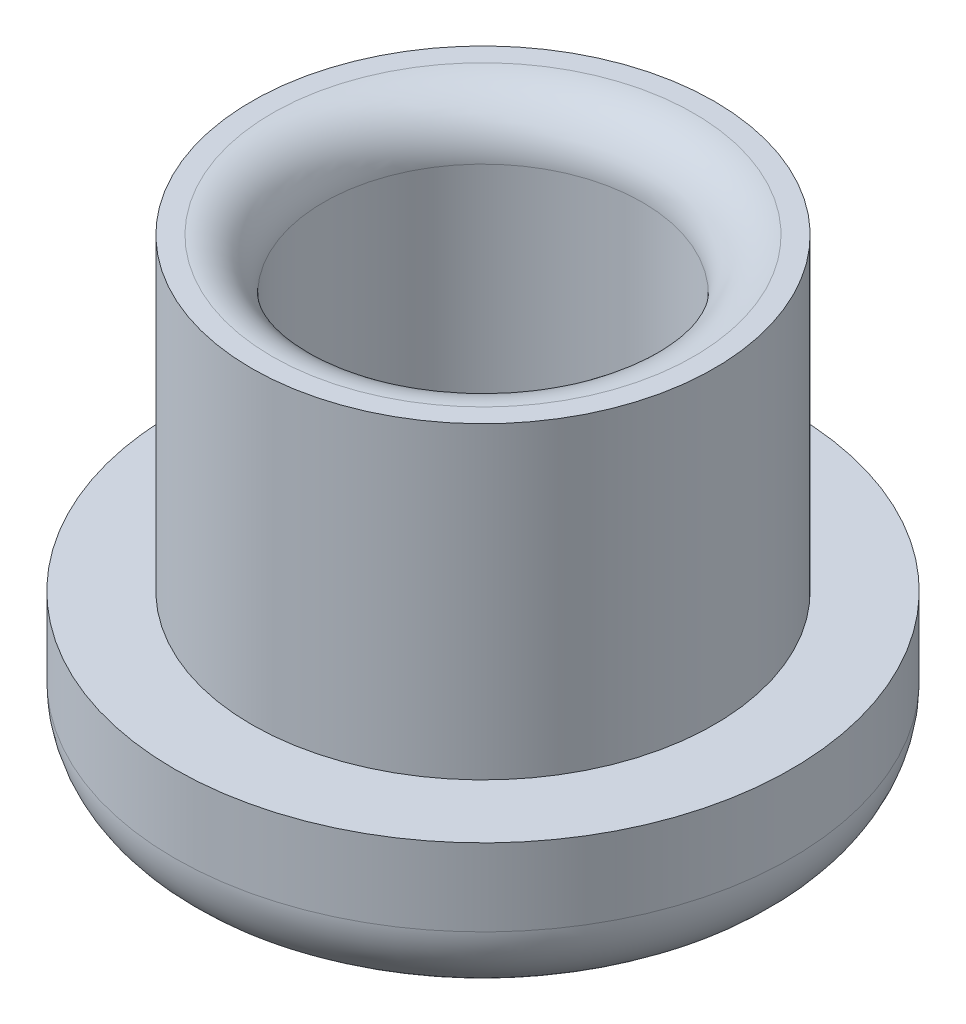
ISO-10303-21;
HEADER;
FILE_DESCRIPTION(('STEP AP214'),'2;1');
FILE_NAME('part.step','',(''),(''),'','','');
FILE_SCHEMA(('AUTOMOTIVE_DESIGN { 1 0 10303 214 1 1 1 1 }'));
ENDSEC;
DATA;
#1=APPLICATION_CONTEXT('core data for automotive mechanical design processes');
#2=APPLICATION_PROTOCOL_DEFINITION('international standard','automotive_design',2000,#1);
#3=PRODUCT_CONTEXT('',#1,'mechanical');
#4=PRODUCT('Part','Part','',(#3));
#5=PRODUCT_RELATED_PRODUCT_CATEGORY('part','',(#4));
#6=PRODUCT_DEFINITION_FORMATION('','',#4);
#7=PRODUCT_DEFINITION_CONTEXT('part definition',#1,'design');
#8=PRODUCT_DEFINITION('design','',#6,#7);
#9=PRODUCT_DEFINITION_SHAPE('','',#8);
#10=(LENGTH_UNIT() NAMED_UNIT(*) SI_UNIT(.MILLI.,.METRE.));
#11=(NAMED_UNIT(*) PLANE_ANGLE_UNIT() SI_UNIT($,.RADIAN.));
#12=(NAMED_UNIT(*) SI_UNIT($,.STERADIAN.) SOLID_ANGLE_UNIT());
#13=UNCERTAINTY_MEASURE_WITH_UNIT(LENGTH_MEASURE(1.E-05),#10,'distance_accuracy_value','');
#14=(GEOMETRIC_REPRESENTATION_CONTEXT(3) GLOBAL_UNCERTAINTY_ASSIGNED_CONTEXT((#13)) GLOBAL_UNIT_ASSIGNED_CONTEXT((#10,
#11,#12)) REPRESENTATION_CONTEXT('',''));
#15=CARTESIAN_POINT('',(0.,0.,0.));
#16=DIRECTION('',(0.,0.,1.));
#17=DIRECTION('',(1.,0.,0.));
#18=AXIS2_PLACEMENT_3D('',#15,#16,#17);
#19=CARTESIAN_POINT('',(0.,3.,0.));
#20=DIRECTION('',(0.,-1.,0.));
#21=DIRECTION('',(0.,0.,-1.));
#22=AXIS2_PLACEMENT_3D('',#19,#20,#21);
#23=CYLINDRICAL_SURFACE('',#22,6.);
#24=CARTESIAN_POINT('',(0.,1.5,0.));
#25=DIRECTION('',(0.,1.,0.));
#26=DIRECTION('',(0.,0.,1.));
#27=AXIS2_PLACEMENT_3D('',#24,#25,#26);
#28=CIRCLE('',#27,6.);
#29=CARTESIAN_POINT('',(0.,1.5,6.));
#30=VERTEX_POINT('',#29);
#31=EDGE_CURVE('E45',#30,#30,#28,.T.);
#32=ORIENTED_EDGE('',*,*,#31,.T.);
#33=EDGE_LOOP('',(#32));
#34=FACE_BOUND('',#33,.T.);
#35=CARTESIAN_POINT('',(0.,3.,0.));
#36=DIRECTION('',(0.,1.,0.));
#37=DIRECTION('',(0.,0.,1.));
#38=AXIS2_PLACEMENT_3D('',#35,#36,#37);
#39=CIRCLE('',#38,6.);
#40=CARTESIAN_POINT('',(0.,3.,6.));
#41=VERTEX_POINT('',#40);
#42=EDGE_CURVE('E64',#41,#41,#39,.T.);
#43=ORIENTED_EDGE('',*,*,#42,.F.);
#44=EDGE_LOOP('',(#43));
#45=FACE_BOUND('',#44,.T.);
#46=ADVANCED_FACE('F38',(#34,#45),#23,.T.);
#47=CARTESIAN_POINT('',(0.,3.,0.));
#48=DIRECTION('',(0.,1.,0.));
#49=DIRECTION('',(0.,0.,1.));
#50=AXIS2_PLACEMENT_3D('',#47,#48,#49);
#51=PLANE('',#50);
#52=CARTESIAN_POINT('',(0.,3.,0.));
#53=DIRECTION('',(0.,1.,0.));
#54=DIRECTION('',(0.,0.,1.));
#55=AXIS2_PLACEMENT_3D('',#52,#53,#54);
#56=CIRCLE('',#55,4.5);
#57=CARTESIAN_POINT('',(0.,3.,4.5));
#58=VERTEX_POINT('',#57);
#59=EDGE_CURVE('E68',#58,#58,#56,.T.);
#60=ORIENTED_EDGE('',*,*,#59,.F.);
#61=EDGE_LOOP('',(#60));
#62=FACE_BOUND('',#61,.T.);
#63=ORIENTED_EDGE('',*,*,#42,.T.);
#64=EDGE_LOOP('',(#63));
#65=FACE_BOUND('',#64,.T.);
#66=ADVANCED_FACE('F83',(#62,#65),#51,.T.);
#67=CARTESIAN_POINT('',(0.,0.,0.));
#68=DIRECTION('',(0.,1.,0.));
#69=DIRECTION('',(0.,0.,1.));
#70=AXIS2_PLACEMENT_3D('',#67,#68,#69);
#71=PLANE('',#70);
#72=CARTESIAN_POINT('',(0.,0.,0.));
#73=DIRECTION('',(0.,1.,0.));
#74=DIRECTION('',(0.,0.,1.));
#75=AXIS2_PLACEMENT_3D('',#72,#73,#74);
#76=CIRCLE('',#75,4.5);
#77=CARTESIAN_POINT('',(0.,0.,4.5));
#78=VERTEX_POINT('',#77);
#79=EDGE_CURVE('E11',#78,#78,#76,.F.);
#80=ORIENTED_EDGE('',*,*,#79,.T.);
#81=EDGE_LOOP('',(#80));
#82=FACE_BOUND('',#81,.T.);
#83=ADVANCED_FACE('F86',(#82),#71,.F.);
#84=CARTESIAN_POINT('',(0.,9.,0.));
#85=DIRECTION('',(0.,1.,0.));
#86=DIRECTION('',(0.,0.,1.));
#87=AXIS2_PLACEMENT_3D('',#84,#85,#86);
#88=PLANE('',#87);
#89=CARTESIAN_POINT('',(0.,9.,0.));
#90=DIRECTION('',(0.,1.,0.));
#91=DIRECTION('',(0.,0.,1.));
#92=AXIS2_PLACEMENT_3D('',#89,#90,#91);
#93=CIRCLE('',#92,4.1);
#94=CARTESIAN_POINT('',(0.,9.,4.1));
#95=VERTEX_POINT('',#94);
#96=EDGE_CURVE('E53',#95,#95,#93,.F.);
#97=ORIENTED_EDGE('',*,*,#96,.T.);
#98=EDGE_LOOP('',(#97));
#99=FACE_BOUND('',#98,.T.);
#100=CARTESIAN_POINT('',(0.,9.,0.));
#101=DIRECTION('',(0.,1.,0.));
#102=DIRECTION('',(0.,0.,1.));
#103=AXIS2_PLACEMENT_3D('',#100,#101,#102);
#104=CIRCLE('',#103,4.5);
#105=CARTESIAN_POINT('',(0.,9.,4.5));
#106=VERTEX_POINT('',#105);
#107=EDGE_CURVE('E67',#106,#106,#104,.T.);
#108=ORIENTED_EDGE('',*,*,#107,.T.);
#109=EDGE_LOOP('',(#108));
#110=FACE_BOUND('',#109,.T.);
#111=ADVANCED_FACE('F74',(#99,#110),#88,.T.);
#112=CARTESIAN_POINT('',(0.,9.,0.));
#113=DIRECTION('',(0.,-1.,0.));
#114=DIRECTION('',(0.,0.,-1.));
#115=AXIS2_PLACEMENT_3D('',#112,#113,#114);
#116=CYLINDRICAL_SURFACE('',#115,4.5);
#117=ORIENTED_EDGE('',*,*,#107,.F.);
#118=EDGE_LOOP('',(#117));
#119=FACE_BOUND('',#118,.T.);
#120=ORIENTED_EDGE('',*,*,#59,.T.);
#121=EDGE_LOOP('',(#120));
#122=FACE_BOUND('',#121,.T.);
#123=ADVANCED_FACE('F76',(#119,#122),#116,.T.);
#124=CARTESIAN_POINT('',(0.,9.,0.));
#125=DIRECTION('',(0.,-1.,0.));
#126=DIRECTION('',(0.,0.,-1.));
#127=AXIS2_PLACEMENT_3D('',#124,#125,#126);
#128=CYLINDRICAL_SURFACE('',#127,3.1);
#129=CARTESIAN_POINT('',(0.,8.,0.));
#130=DIRECTION('',(0.,1.,0.));
#131=DIRECTION('',(0.,0.,1.));
#132=AXIS2_PLACEMENT_3D('',#129,#130,#131);
#133=CIRCLE('',#132,3.1);
#134=CARTESIAN_POINT('',(0.,8.,3.1));
#135=VERTEX_POINT('',#134);
#136=EDGE_CURVE('E58',#135,#135,#133,.T.);
#137=ORIENTED_EDGE('',*,*,#136,.T.);
#138=EDGE_LOOP('',(#137));
#139=FACE_BOUND('',#138,.T.);
#140=CARTESIAN_POINT('',(0.,4.,0.));
#141=DIRECTION('',(0.,1.,0.));
#142=DIRECTION('',(0.,0.,1.));
#143=AXIS2_PLACEMENT_3D('',#140,#141,#142);
#144=CIRCLE('',#143,3.1);
#145=CARTESIAN_POINT('',(0.,4.,3.1));
#146=VERTEX_POINT('',#145);
#147=EDGE_CURVE('E61',#146,#146,#144,.F.);
#148=ORIENTED_EDGE('',*,*,#147,.T.);
#149=EDGE_LOOP('',(#148));
#150=FACE_BOUND('',#149,.T.);
#151=ADVANCED_FACE('F79',(#139,#150),#128,.F.);
#152=CARTESIAN_POINT('',(0.,3.,0.));
#153=DIRECTION('',(0.,1.,0.));
#154=DIRECTION('',(0.,0.,1.));
#155=AXIS2_PLACEMENT_3D('',#152,#153,#154);
#156=CIRCLE('',#155,2.1);
#157=CARTESIAN_POINT('',(0.,3.,2.1));
#158=VERTEX_POINT('',#157);
#159=EDGE_CURVE('E49',#158,#158,#156,.T.);
#160=ORIENTED_EDGE('',*,*,#159,.T.);
#161=EDGE_LOOP('',(#160));
#162=FACE_BOUND('',#161,.T.);
#163=ADVANCED_FACE('F88',(#162),#51,.T.);
#164=CARTESIAN_POINT('',(0.,8.,0.));
#165=DIRECTION('',(0.,1.,0.));
#166=DIRECTION('',(0.,0.,1.));
#167=AXIS2_PLACEMENT_3D('',#164,#165,#166);
#168=TOROIDAL_SURFACE('',#167,4.1,1.);
#169=ORIENTED_EDGE('',*,*,#96,.F.);
#170=EDGE_LOOP('',(#169));
#171=FACE_BOUND('',#170,.T.);
#172=ORIENTED_EDGE('',*,*,#136,.F.);
#173=EDGE_LOOP('',(#172));
#174=FACE_BOUND('',#173,.T.);
#175=ADVANCED_FACE('F97',(#171,#174),#168,.T.);
#176=CARTESIAN_POINT('',(0.,4.,0.));
#177=DIRECTION('',(0.,1.,0.));
#178=DIRECTION('',(0.,0.,1.));
#179=AXIS2_PLACEMENT_3D('',#176,#177,#178);
#180=TOROIDAL_SURFACE('',#179,2.1,1.);
#181=ORIENTED_EDGE('',*,*,#159,.F.);
#182=EDGE_LOOP('',(#181));
#183=FACE_BOUND('',#182,.T.);
#184=ORIENTED_EDGE('',*,*,#147,.F.);
#185=EDGE_LOOP('',(#184));
#186=FACE_BOUND('',#185,.T.);
#187=ADVANCED_FACE('F99',(#183,#186),#180,.F.);
#188=CARTESIAN_POINT('',(0.,1.5,0.));
#189=DIRECTION('',(0.,1.,0.));
#190=DIRECTION('',(0.,0.,1.));
#191=AXIS2_PLACEMENT_3D('',#188,#189,#190);
#192=TOROIDAL_SURFACE('',#191,4.5,1.5);
#193=ORIENTED_EDGE('',*,*,#79,.F.);
#194=EDGE_LOOP('',(#193));
#195=FACE_BOUND('',#194,.T.);
#196=ORIENTED_EDGE('',*,*,#31,.F.);
#197=EDGE_LOOP('',(#196));
#198=FACE_BOUND('',#197,.T.);
#199=ADVANCED_FACE('F40',(#195,#198),#192,.T.);
#200=CLOSED_SHELL('',(#46,#66,#83,#111,#123,#151,#163,#175,#187,#199));
#201=MANIFOLD_SOLID_BREP('B2',#200);
#202=ADVANCED_BREP_SHAPE_REPRESENTATION('',(#18,#201),#14);
#203=SHAPE_DEFINITION_REPRESENTATION(#9,#202);
ENDSEC;
END-ISO-10303-21;
